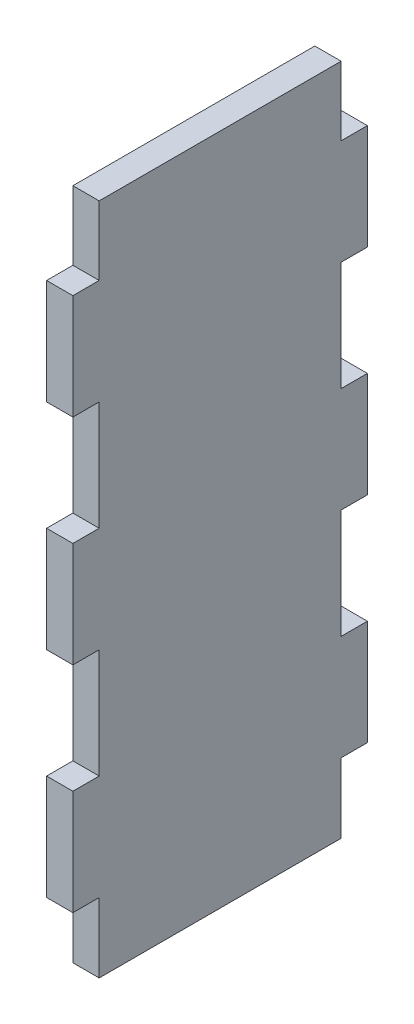
ISO-10303-21;
HEADER;
FILE_DESCRIPTION(('STEP AP214'),'2;1');
FILE_NAME('part.step','',(''),(''),'','','');
FILE_SCHEMA(('AUTOMOTIVE_DESIGN { 1 0 10303 214 1 1 1 1 }'));
ENDSEC;
DATA;
#1=APPLICATION_CONTEXT('core data for automotive mechanical design processes');
#2=APPLICATION_PROTOCOL_DEFINITION('international standard','automotive_design',2000,#1);
#3=PRODUCT_CONTEXT('',#1,'mechanical');
#4=PRODUCT('Part','Part','',(#3));
#5=PRODUCT_RELATED_PRODUCT_CATEGORY('part','',(#4));
#6=PRODUCT_DEFINITION_FORMATION('','',#4);
#7=PRODUCT_DEFINITION_CONTEXT('part definition',#1,'design');
#8=PRODUCT_DEFINITION('design','',#6,#7);
#9=PRODUCT_DEFINITION_SHAPE('','',#8);
#10=(LENGTH_UNIT() NAMED_UNIT(*) SI_UNIT(.MILLI.,.METRE.));
#11=(NAMED_UNIT(*) PLANE_ANGLE_UNIT() SI_UNIT($,.RADIAN.));
#12=(NAMED_UNIT(*) SI_UNIT($,.STERADIAN.) SOLID_ANGLE_UNIT());
#13=UNCERTAINTY_MEASURE_WITH_UNIT(LENGTH_MEASURE(1.E-05),#10,'distance_accuracy_value','');
#14=(GEOMETRIC_REPRESENTATION_CONTEXT(3) GLOBAL_UNCERTAINTY_ASSIGNED_CONTEXT((#13)) GLOBAL_UNIT_ASSIGNED_CONTEXT((#10,
#11,#12)) REPRESENTATION_CONTEXT('',''));
#15=CARTESIAN_POINT('',(0.,0.,0.));
#16=DIRECTION('',(0.,0.,1.));
#17=DIRECTION('',(1.,0.,0.));
#18=AXIS2_PLACEMENT_3D('',#15,#16,#17);
#19=CARTESIAN_POINT('',(3.175,-45.466,17.78));
#20=DIRECTION('',(1.,0.,0.));
#21=DIRECTION('',(0.,0.,-1.));
#22=AXIS2_PLACEMENT_3D('',#19,#20,#21);
#23=PLANE('',#22);
#24=DIRECTION('',(0.,1.,0.));
#25=VECTOR('',#24,1.);
#26=CARTESIAN_POINT('',(3.175,-32.258,14.605));
#27=LINE('',#26,#25);
#28=CARTESIAN_POINT('',(3.175,-40.6736683322111,14.605));
#29=VERTEX_POINT('',#28);
#30=CARTESIAN_POINT('',(3.175,-32.258,14.605));
#31=VERTEX_POINT('',#30);
#32=EDGE_CURVE('E241',#29,#31,#27,.T.);
#33=ORIENTED_EDGE('',*,*,#32,.F.);
#34=DIRECTION('',(0.,0.,1.));
#35=VECTOR('',#34,1.);
#36=CARTESIAN_POINT('',(3.175,-40.6736683322111,-17.78));
#37=LINE('',#36,#35);
#38=CARTESIAN_POINT('',(3.175,-40.6736683322111,-14.605));
#39=VERTEX_POINT('',#38);
#40=EDGE_CURVE('E47',#39,#29,#37,.T.);
#41=ORIENTED_EDGE('',*,*,#40,.F.);
#42=DIRECTION('',(0.,-1.,0.));
#43=VECTOR('',#42,1.);
#44=CARTESIAN_POINT('',(3.175,-32.258,-14.605));
#45=LINE('',#44,#43);
#46=CARTESIAN_POINT('',(3.175,-32.258,-14.605));
#47=VERTEX_POINT('',#46);
#48=EDGE_CURVE('E308',#47,#39,#45,.T.);
#49=ORIENTED_EDGE('',*,*,#48,.F.);
#50=DIRECTION('',(0.,0.,1.));
#51=VECTOR('',#50,1.);
#52=CARTESIAN_POINT('',(3.175,-32.258,-17.78));
#53=LINE('',#52,#51);
#54=CARTESIAN_POINT('',(3.175,-32.258,-17.78));
#55=VERTEX_POINT('',#54);
#56=EDGE_CURVE('E300',#55,#47,#53,.T.);
#57=ORIENTED_EDGE('',*,*,#56,.F.);
#58=DIRECTION('',(0.,1.,0.));
#59=VECTOR('',#58,1.);
#60=CARTESIAN_POINT('',(3.175,45.466,-17.78));
#61=LINE('',#60,#59);
#62=CARTESIAN_POINT('',(3.175,-19.558,-17.78));
#63=VERTEX_POINT('',#62);
#64=EDGE_CURVE('E40',#55,#63,#61,.T.);
#65=ORIENTED_EDGE('',*,*,#64,.T.);
#66=DIRECTION('',(0.,0.,-1.));
#67=VECTOR('',#66,1.);
#68=CARTESIAN_POINT('',(3.175,-19.558,-17.78));
#69=LINE('',#68,#67);
#70=CARTESIAN_POINT('',(3.175,-19.558,-14.605));
#71=VERTEX_POINT('',#70);
#72=EDGE_CURVE('E418',#71,#63,#69,.T.);
#73=ORIENTED_EDGE('',*,*,#72,.F.);
#74=DIRECTION('',(0.,-1.,0.));
#75=VECTOR('',#74,1.);
#76=CARTESIAN_POINT('',(3.175,-6.35,-14.605));
#77=LINE('',#76,#75);
#78=CARTESIAN_POINT('',(3.175,-6.35,-14.605));
#79=VERTEX_POINT('',#78);
#80=EDGE_CURVE('E426',#79,#71,#77,.T.);
#81=ORIENTED_EDGE('',*,*,#80,.F.);
#82=DIRECTION('',(0.,0.,1.));
#83=VECTOR('',#82,1.);
#84=CARTESIAN_POINT('',(3.175,-6.35,-17.78));
#85=LINE('',#84,#83);
#86=CARTESIAN_POINT('',(3.175,-6.35,-17.78));
#87=VERTEX_POINT('',#86);
#88=EDGE_CURVE('E407',#87,#79,#85,.T.);
#89=ORIENTED_EDGE('',*,*,#88,.F.);
#90=CARTESIAN_POINT('',(3.175,6.35,-17.78));
#91=VERTEX_POINT('',#90);
#92=EDGE_CURVE('E343',#87,#91,#61,.T.);
#93=ORIENTED_EDGE('',*,*,#92,.T.);
#94=DIRECTION('',(0.,0.,-1.));
#95=VECTOR('',#94,1.);
#96=CARTESIAN_POINT('',(3.175,6.35,-17.78));
#97=LINE('',#96,#95);
#98=CARTESIAN_POINT('',(3.175,6.35,-14.605));
#99=VERTEX_POINT('',#98);
#100=EDGE_CURVE('E394',#99,#91,#97,.T.);
#101=ORIENTED_EDGE('',*,*,#100,.F.);
#102=DIRECTION('',(0.,-1.,0.));
#103=VECTOR('',#102,1.);
#104=CARTESIAN_POINT('',(3.175,19.558,-14.605));
#105=LINE('',#104,#103);
#106=CARTESIAN_POINT('',(3.175,19.558,-14.605));
#107=VERTEX_POINT('',#106);
#108=EDGE_CURVE('E402',#107,#99,#105,.T.);
#109=ORIENTED_EDGE('',*,*,#108,.F.);
#110=DIRECTION('',(0.,0.,1.));
#111=VECTOR('',#110,1.);
#112=CARTESIAN_POINT('',(3.175,19.558,-17.78));
#113=LINE('',#112,#111);
#114=CARTESIAN_POINT('',(3.175,19.558,-17.78));
#115=VERTEX_POINT('',#114);
#116=EDGE_CURVE('E390',#115,#107,#113,.T.);
#117=ORIENTED_EDGE('',*,*,#116,.F.);
#118=CARTESIAN_POINT('',(3.175,32.258,-17.78));
#119=VERTEX_POINT('',#118);
#120=EDGE_CURVE('E338',#115,#119,#61,.T.);
#121=ORIENTED_EDGE('',*,*,#120,.T.);
#122=DIRECTION('',(0.,0.,-1.));
#123=VECTOR('',#122,1.);
#124=CARTESIAN_POINT('',(3.175,32.258,-17.78));
#125=LINE('',#124,#123);
#126=CARTESIAN_POINT('',(3.175,32.258,-14.605));
#127=VERTEX_POINT('',#126);
#128=EDGE_CURVE('E382',#127,#119,#125,.T.);
#129=ORIENTED_EDGE('',*,*,#128,.F.);
#130=DIRECTION('',(0.,-1.,0.));
#131=VECTOR('',#130,1.);
#132=CARTESIAN_POINT('',(3.175,45.466,-14.605));
#133=LINE('',#132,#131);
#134=CARTESIAN_POINT('',(3.175,40.5809527450316,-14.605));
#135=VERTEX_POINT('',#134);
#136=EDGE_CURVE('E386',#135,#127,#133,.T.);
#137=ORIENTED_EDGE('',*,*,#136,.F.);
#138=DIRECTION('',(0.,0.,1.));
#139=VECTOR('',#138,1.);
#140=CARTESIAN_POINT('',(3.175,40.5809527450316,-17.78));
#141=LINE('',#140,#139);
#142=CARTESIAN_POINT('',(3.175,40.5809527450316,14.605));
#143=VERTEX_POINT('',#142);
#144=EDGE_CURVE('E54',#135,#143,#141,.T.);
#145=ORIENTED_EDGE('',*,*,#144,.T.);
#146=DIRECTION('',(0.,1.,0.));
#147=VECTOR('',#146,1.);
#148=CARTESIAN_POINT('',(3.175,45.466,14.605));
#149=LINE('',#148,#147);
#150=CARTESIAN_POINT('',(3.175,32.258,14.605));
#151=VERTEX_POINT('',#150);
#152=EDGE_CURVE('E323',#151,#143,#149,.T.);
#153=ORIENTED_EDGE('',*,*,#152,.F.);
#154=DIRECTION('',(0.,0.,-1.));
#155=VECTOR('',#154,1.);
#156=CARTESIAN_POINT('',(3.175,32.258,17.78));
#157=LINE('',#156,#155);
#158=CARTESIAN_POINT('',(3.175,32.258,17.78));
#159=VERTEX_POINT('',#158);
#160=EDGE_CURVE('E317',#159,#151,#157,.T.);
#161=ORIENTED_EDGE('',*,*,#160,.F.);
#162=DIRECTION('',(0.,-1.,0.));
#163=VECTOR('',#162,1.);
#164=CARTESIAN_POINT('',(3.175,45.466,17.78));
#165=LINE('',#164,#163);
#166=CARTESIAN_POINT('',(3.175,19.558,17.78));
#167=VERTEX_POINT('',#166);
#168=EDGE_CURVE('E335',#159,#167,#165,.T.);
#169=ORIENTED_EDGE('',*,*,#168,.T.);
#170=DIRECTION('',(0.,0.,1.));
#171=VECTOR('',#170,1.);
#172=CARTESIAN_POINT('',(3.175,19.558,17.78));
#173=LINE('',#172,#171);
#174=CARTESIAN_POINT('',(3.175,19.558,14.605));
#175=VERTEX_POINT('',#174);
#176=EDGE_CURVE('E284',#175,#167,#173,.T.);
#177=ORIENTED_EDGE('',*,*,#176,.F.);
#178=DIRECTION('',(0.,1.,0.));
#179=VECTOR('',#178,1.);
#180=CARTESIAN_POINT('',(3.175,19.558,14.605));
#181=LINE('',#180,#179);
#182=CARTESIAN_POINT('',(3.175,6.35,14.605));
#183=VERTEX_POINT('',#182);
#184=EDGE_CURVE('E293',#183,#175,#181,.T.);
#185=ORIENTED_EDGE('',*,*,#184,.F.);
#186=DIRECTION('',(0.,0.,-1.));
#187=VECTOR('',#186,1.);
#188=CARTESIAN_POINT('',(3.175,6.35,17.78));
#189=LINE('',#188,#187);
#190=CARTESIAN_POINT('',(3.175,6.35,17.78));
#191=VERTEX_POINT('',#190);
#192=EDGE_CURVE('E274',#191,#183,#189,.T.);
#193=ORIENTED_EDGE('',*,*,#192,.F.);
#194=CARTESIAN_POINT('',(3.175,-6.35,17.78));
#195=VERTEX_POINT('',#194);
#196=EDGE_CURVE('E339',#191,#195,#165,.T.);
#197=ORIENTED_EDGE('',*,*,#196,.T.);
#198=DIRECTION('',(0.,0.,1.));
#199=VECTOR('',#198,1.);
#200=CARTESIAN_POINT('',(3.175,-6.35,17.78));
#201=LINE('',#200,#199);
#202=CARTESIAN_POINT('',(3.175,-6.35,14.605));
#203=VERTEX_POINT('',#202);
#204=EDGE_CURVE('E258',#203,#195,#201,.T.);
#205=ORIENTED_EDGE('',*,*,#204,.F.);
#206=DIRECTION('',(0.,1.,0.));
#207=VECTOR('',#206,1.);
#208=CARTESIAN_POINT('',(3.175,-6.35,14.605));
#209=LINE('',#208,#207);
#210=CARTESIAN_POINT('',(3.175,-19.558,14.605));
#211=VERTEX_POINT('',#210);
#212=EDGE_CURVE('E267',#211,#203,#209,.T.);
#213=ORIENTED_EDGE('',*,*,#212,.F.);
#214=DIRECTION('',(0.,0.,-1.));
#215=VECTOR('',#214,1.);
#216=CARTESIAN_POINT('',(3.175,-19.558,17.78));
#217=LINE('',#216,#215);
#218=CARTESIAN_POINT('',(3.175,-19.558,17.78));
#219=VERTEX_POINT('',#218);
#220=EDGE_CURVE('E252',#219,#211,#217,.T.);
#221=ORIENTED_EDGE('',*,*,#220,.F.);
#222=CARTESIAN_POINT('',(3.175,-32.258,17.78));
#223=VERTEX_POINT('',#222);
#224=EDGE_CURVE('E340',#219,#223,#165,.T.);
#225=ORIENTED_EDGE('',*,*,#224,.T.);
#226=DIRECTION('',(0.,0.,1.));
#227=VECTOR('',#226,1.);
#228=CARTESIAN_POINT('',(3.175,-32.258,17.78));
#229=LINE('',#228,#227);
#230=EDGE_CURVE('E238',#31,#223,#229,.T.);
#231=ORIENTED_EDGE('',*,*,#230,.F.);
#232=EDGE_LOOP('',(#33,#41,#49,#57,#65,#73,#81,#89,#93,#101,#109,#117,#121,#129,#137,#145,#153,
#161,#169,#177,#185,#193,#197,#205,#213,#221,#225,#231));
#233=FACE_BOUND('',#232,.T.);
#234=ADVANCED_FACE('F32',(#233),#23,.T.);
#235=CARTESIAN_POINT('',(0.,-45.466,17.78));
#236=DIRECTION('',(1.,0.,0.));
#237=DIRECTION('',(0.,0.,-1.));
#238=AXIS2_PLACEMENT_3D('',#235,#236,#237);
#239=PLANE('',#238);
#240=DIRECTION('',(0.,0.,1.));
#241=VECTOR('',#240,1.);
#242=CARTESIAN_POINT('',(0.,-40.6736683322111,-17.78));
#243=LINE('',#242,#241);
#244=CARTESIAN_POINT('',(0.,-40.6736683322111,-14.605));
#245=VERTEX_POINT('',#244);
#246=CARTESIAN_POINT('',(0.,-40.6736683322111,14.605));
#247=VERTEX_POINT('',#246);
#248=EDGE_CURVE('E216',#245,#247,#243,.T.);
#249=ORIENTED_EDGE('',*,*,#248,.T.);
#250=DIRECTION('',(0.,1.,0.));
#251=VECTOR('',#250,1.);
#252=CARTESIAN_POINT('',(0.,-32.258,14.605));
#253=LINE('',#252,#251);
#254=CARTESIAN_POINT('',(0.,-32.258,14.605));
#255=VERTEX_POINT('',#254);
#256=EDGE_CURVE('E226',#247,#255,#253,.T.);
#257=ORIENTED_EDGE('',*,*,#256,.T.);
#258=DIRECTION('',(0.,0.,1.));
#259=VECTOR('',#258,1.);
#260=CARTESIAN_POINT('',(0.,-32.258,17.78));
#261=LINE('',#260,#259);
#262=CARTESIAN_POINT('',(0.,-32.258,17.78));
#263=VERTEX_POINT('',#262);
#264=EDGE_CURVE('E237',#255,#263,#261,.T.);
#265=ORIENTED_EDGE('',*,*,#264,.T.);
#266=DIRECTION('',(0.,-1.,0.));
#267=VECTOR('',#266,1.);
#268=CARTESIAN_POINT('',(0.,45.466,17.78));
#269=LINE('',#268,#267);
#270=CARTESIAN_POINT('',(0.,-19.558,17.78));
#271=VERTEX_POINT('',#270);
#272=EDGE_CURVE('E333',#271,#263,#269,.T.);
#273=ORIENTED_EDGE('',*,*,#272,.F.);
#274=DIRECTION('',(0.,0.,-1.));
#275=VECTOR('',#274,1.);
#276=CARTESIAN_POINT('',(0.,-19.558,17.78));
#277=LINE('',#276,#275);
#278=CARTESIAN_POINT('',(0.,-19.558,14.605));
#279=VERTEX_POINT('',#278);
#280=EDGE_CURVE('E254',#271,#279,#277,.T.);
#281=ORIENTED_EDGE('',*,*,#280,.T.);
#282=DIRECTION('',(0.,1.,0.));
#283=VECTOR('',#282,1.);
#284=CARTESIAN_POINT('',(0.,-6.35,14.605));
#285=LINE('',#284,#283);
#286=CARTESIAN_POINT('',(0.,-6.35,14.605));
#287=VERTEX_POINT('',#286);
#288=EDGE_CURVE('E257',#279,#287,#285,.T.);
#289=ORIENTED_EDGE('',*,*,#288,.T.);
#290=DIRECTION('',(0.,0.,1.));
#291=VECTOR('',#290,1.);
#292=CARTESIAN_POINT('',(0.,-6.35,17.78));
#293=LINE('',#292,#291);
#294=CARTESIAN_POINT('',(0.,-6.35,17.78));
#295=VERTEX_POINT('',#294);
#296=EDGE_CURVE('E261',#287,#295,#293,.T.);
#297=ORIENTED_EDGE('',*,*,#296,.T.);
#298=CARTESIAN_POINT('',(0.,6.35,17.78));
#299=VERTEX_POINT('',#298);
#300=EDGE_CURVE('E347',#299,#295,#269,.T.);
#301=ORIENTED_EDGE('',*,*,#300,.F.);
#302=DIRECTION('',(0.,0.,-1.));
#303=VECTOR('',#302,1.);
#304=CARTESIAN_POINT('',(0.,6.35,17.78));
#305=LINE('',#304,#303);
#306=CARTESIAN_POINT('',(0.,6.35,14.605));
#307=VERTEX_POINT('',#306);
#308=EDGE_CURVE('E280',#299,#307,#305,.T.);
#309=ORIENTED_EDGE('',*,*,#308,.T.);
#310=DIRECTION('',(0.,1.,0.));
#311=VECTOR('',#310,1.);
#312=CARTESIAN_POINT('',(0.,19.558,14.605));
#313=LINE('',#312,#311);
#314=CARTESIAN_POINT('',(0.,19.558,14.605));
#315=VERTEX_POINT('',#314);
#316=EDGE_CURVE('E283',#307,#315,#313,.T.);
#317=ORIENTED_EDGE('',*,*,#316,.T.);
#318=DIRECTION('',(0.,0.,1.));
#319=VECTOR('',#318,1.);
#320=CARTESIAN_POINT('',(0.,19.558,17.78));
#321=LINE('',#320,#319);
#322=CARTESIAN_POINT('',(0.,19.558,17.78));
#323=VERTEX_POINT('',#322);
#324=EDGE_CURVE('E287',#315,#323,#321,.T.);
#325=ORIENTED_EDGE('',*,*,#324,.T.);
#326=CARTESIAN_POINT('',(0.,32.258,17.78));
#327=VERTEX_POINT('',#326);
#328=EDGE_CURVE('E344',#327,#323,#269,.T.);
#329=ORIENTED_EDGE('',*,*,#328,.F.);
#330=DIRECTION('',(0.,0.,-1.));
#331=VECTOR('',#330,1.);
#332=CARTESIAN_POINT('',(0.,32.258,17.78));
#333=LINE('',#332,#331);
#334=CARTESIAN_POINT('',(0.,32.258,14.605));
#335=VERTEX_POINT('',#334);
#336=EDGE_CURVE('E319',#327,#335,#333,.T.);
#337=ORIENTED_EDGE('',*,*,#336,.T.);
#338=DIRECTION('',(0.,1.,0.));
#339=VECTOR('',#338,1.);
#340=CARTESIAN_POINT('',(0.,45.466,14.605));
#341=LINE('',#340,#339);
#342=CARTESIAN_POINT('',(0.,40.5809527450316,14.605));
#343=VERTEX_POINT('',#342);
#344=EDGE_CURVE('E322',#335,#343,#341,.T.);
#345=ORIENTED_EDGE('',*,*,#344,.T.);
#346=DIRECTION('',(0.,0.,1.));
#347=VECTOR('',#346,1.);
#348=CARTESIAN_POINT('',(0.,40.5809527450316,-17.78));
#349=LINE('',#348,#347);
#350=CARTESIAN_POINT('',(0.,40.5809527450316,-14.605));
#351=VERTEX_POINT('',#350);
#352=EDGE_CURVE('E388',#351,#343,#349,.T.);
#353=ORIENTED_EDGE('',*,*,#352,.F.);
#354=DIRECTION('',(0.,-1.,0.));
#355=VECTOR('',#354,1.);
#356=CARTESIAN_POINT('',(0.,45.466,-14.605));
#357=LINE('',#356,#355);
#358=CARTESIAN_POINT('',(0.,32.258,-14.605));
#359=VERTEX_POINT('',#358);
#360=EDGE_CURVE('E375',#351,#359,#357,.T.);
#361=ORIENTED_EDGE('',*,*,#360,.T.);
#362=DIRECTION('',(0.,0.,-1.));
#363=VECTOR('',#362,1.);
#364=CARTESIAN_POINT('',(0.,32.258,-17.78));
#365=LINE('',#364,#363);
#366=CARTESIAN_POINT('',(0.,32.258,-17.78));
#367=VERTEX_POINT('',#366);
#368=EDGE_CURVE('E372',#359,#367,#365,.T.);
#369=ORIENTED_EDGE('',*,*,#368,.T.);
#370=DIRECTION('',(0.,1.,0.));
#371=VECTOR('',#370,1.);
#372=CARTESIAN_POINT('',(0.,45.466,-17.78));
#373=LINE('',#372,#371);
#374=CARTESIAN_POINT('',(0.,19.558,-17.78));
#375=VERTEX_POINT('',#374);
#376=EDGE_CURVE('E346',#375,#367,#373,.T.);
#377=ORIENTED_EDGE('',*,*,#376,.F.);
#378=DIRECTION('',(0.,0.,1.));
#379=VECTOR('',#378,1.);
#380=CARTESIAN_POINT('',(0.,19.558,-17.78));
#381=LINE('',#380,#379);
#382=CARTESIAN_POINT('',(0.,19.558,-14.605));
#383=VERTEX_POINT('',#382);
#384=EDGE_CURVE('E370',#375,#383,#381,.T.);
#385=ORIENTED_EDGE('',*,*,#384,.T.);
#386=DIRECTION('',(0.,-1.,0.));
#387=VECTOR('',#386,1.);
#388=CARTESIAN_POINT('',(0.,19.558,-14.605));
#389=LINE('',#388,#387);
#390=CARTESIAN_POINT('',(0.,6.35,-14.605));
#391=VERTEX_POINT('',#390);
#392=EDGE_CURVE('E393',#383,#391,#389,.T.);
#393=ORIENTED_EDGE('',*,*,#392,.T.);
#394=DIRECTION('',(0.,0.,-1.));
#395=VECTOR('',#394,1.);
#396=CARTESIAN_POINT('',(0.,6.35,-17.78));
#397=LINE('',#396,#395);
#398=CARTESIAN_POINT('',(0.,6.35,-17.78));
#399=VERTEX_POINT('',#398);
#400=EDGE_CURVE('E396',#391,#399,#397,.T.);
#401=ORIENTED_EDGE('',*,*,#400,.T.);
#402=CARTESIAN_POINT('',(0.,-6.35,-17.78));
#403=VERTEX_POINT('',#402);
#404=EDGE_CURVE('E350',#403,#399,#373,.T.);
#405=ORIENTED_EDGE('',*,*,#404,.F.);
#406=DIRECTION('',(0.,0.,1.));
#407=VECTOR('',#406,1.);
#408=CARTESIAN_POINT('',(0.,-6.35,-17.78));
#409=LINE('',#408,#407);
#410=CARTESIAN_POINT('',(0.,-6.35,-14.605));
#411=VERTEX_POINT('',#410);
#412=EDGE_CURVE('E414',#403,#411,#409,.T.);
#413=ORIENTED_EDGE('',*,*,#412,.T.);
#414=DIRECTION('',(0.,-1.,0.));
#415=VECTOR('',#414,1.);
#416=CARTESIAN_POINT('',(0.,-6.35,-14.605));
#417=LINE('',#416,#415);
#418=CARTESIAN_POINT('',(0.,-19.558,-14.605));
#419=VERTEX_POINT('',#418);
#420=EDGE_CURVE('E417',#411,#419,#417,.T.);
#421=ORIENTED_EDGE('',*,*,#420,.T.);
#422=DIRECTION('',(0.,0.,-1.));
#423=VECTOR('',#422,1.);
#424=CARTESIAN_POINT('',(0.,-19.558,-17.78));
#425=LINE('',#424,#423);
#426=CARTESIAN_POINT('',(0.,-19.558,-17.78));
#427=VERTEX_POINT('',#426);
#428=EDGE_CURVE('E421',#419,#427,#425,.T.);
#429=ORIENTED_EDGE('',*,*,#428,.T.);
#430=CARTESIAN_POINT('',(0.,-32.258,-17.78));
#431=VERTEX_POINT('',#430);
#432=EDGE_CURVE('E348',#431,#427,#373,.T.);
#433=ORIENTED_EDGE('',*,*,#432,.F.);
#434=DIRECTION('',(0.,0.,1.));
#435=VECTOR('',#434,1.);
#436=CARTESIAN_POINT('',(0.,-32.258,-17.78));
#437=LINE('',#436,#435);
#438=CARTESIAN_POINT('',(0.,-32.258,-14.605));
#439=VERTEX_POINT('',#438);
#440=EDGE_CURVE('E306',#431,#439,#437,.T.);
#441=ORIENTED_EDGE('',*,*,#440,.T.);
#442=DIRECTION('',(0.,-1.,0.));
#443=VECTOR('',#442,1.);
#444=CARTESIAN_POINT('',(0.,-32.258,-14.605));
#445=LINE('',#444,#443);
#446=EDGE_CURVE('E230',#439,#245,#445,.T.);
#447=ORIENTED_EDGE('',*,*,#446,.T.);
#448=EDGE_LOOP('',(#249,#257,#265,#273,#281,#289,#297,#301,#309,#317,#325,#329,#337,#345,#353,
#361,#369,#377,#385,#393,#401,#405,#413,#421,#429,#433,#441,#447));
#449=FACE_BOUND('',#448,.T.);
#450=ADVANCED_FACE('F224',(#449),#239,.F.);
#451=CARTESIAN_POINT('',(0.,-32.258,-14.605));
#452=DIRECTION('',(0.,0.,1.));
#453=DIRECTION('',(0.,-1.,0.));
#454=AXIS2_PLACEMENT_3D('',#451,#452,#453);
#455=PLANE('',#454);
#456=DIRECTION('',(1.,0.,0.));
#457=VECTOR('',#456,1.);
#458=CARTESIAN_POINT('',(0.,-40.6736683322111,-14.605));
#459=LINE('',#458,#457);
#460=EDGE_CURVE('E231',#245,#39,#459,.T.);
#461=ORIENTED_EDGE('',*,*,#460,.F.);
#462=ORIENTED_EDGE('',*,*,#446,.F.);
#463=DIRECTION('',(1.,0.,0.));
#464=VECTOR('',#463,1.);
#465=CARTESIAN_POINT('',(0.,-32.258,-14.605));
#466=LINE('',#465,#464);
#467=EDGE_CURVE('E310',#439,#47,#466,.T.);
#468=ORIENTED_EDGE('',*,*,#467,.T.);
#469=ORIENTED_EDGE('',*,*,#48,.T.);
#470=EDGE_LOOP('',(#461,#462,#468,#469));
#471=FACE_BOUND('',#470,.T.);
#472=ADVANCED_FACE('F483',(#471),#455,.F.);
#473=CARTESIAN_POINT('',(0.,-32.258,14.605));
#474=DIRECTION('',(0.,0.,-1.));
#475=DIRECTION('',(0.,1.,0.));
#476=AXIS2_PLACEMENT_3D('',#473,#474,#475);
#477=PLANE('',#476);
#478=DIRECTION('',(1.,0.,0.));
#479=VECTOR('',#478,1.);
#480=CARTESIAN_POINT('',(1.58750000000001,-40.6736683322111,14.605));
#481=LINE('',#480,#479);
#482=EDGE_CURVE('E213',#247,#29,#481,.T.);
#483=ORIENTED_EDGE('',*,*,#482,.T.);
#484=ORIENTED_EDGE('',*,*,#32,.T.);
#485=DIRECTION('',(1.,0.,0.));
#486=VECTOR('',#485,1.);
#487=CARTESIAN_POINT('',(0.,-32.258,14.605));
#488=LINE('',#487,#486);
#489=EDGE_CURVE('E236',#255,#31,#488,.T.);
#490=ORIENTED_EDGE('',*,*,#489,.F.);
#491=ORIENTED_EDGE('',*,*,#256,.F.);
#492=EDGE_LOOP('',(#483,#484,#490,#491));
#493=FACE_BOUND('',#492,.T.);
#494=ADVANCED_FACE('F234',(#493),#477,.F.);
#495=CARTESIAN_POINT('',(0.,45.466,14.605));
#496=DIRECTION('',(0.,0.,-1.));
#497=DIRECTION('',(0.,1.,0.));
#498=AXIS2_PLACEMENT_3D('',#495,#496,#497);
#499=PLANE('',#498);
#500=DIRECTION('',(-1.,0.,0.));
#501=VECTOR('',#500,1.);
#502=CARTESIAN_POINT('',(1.58750000000001,40.5809527450316,14.605));
#503=LINE('',#502,#501);
#504=EDGE_CURVE('E552',#143,#343,#503,.T.);
#505=ORIENTED_EDGE('',*,*,#504,.T.);
#506=ORIENTED_EDGE('',*,*,#344,.F.);
#507=DIRECTION('',(1.,0.,0.));
#508=VECTOR('',#507,1.);
#509=CARTESIAN_POINT('',(0.,32.258,14.605));
#510=LINE('',#509,#508);
#511=EDGE_CURVE('E331',#335,#151,#510,.T.);
#512=ORIENTED_EDGE('',*,*,#511,.T.);
#513=ORIENTED_EDGE('',*,*,#152,.T.);
#514=EDGE_LOOP('',(#505,#506,#512,#513));
#515=FACE_BOUND('',#514,.T.);
#516=ADVANCED_FACE('F551',(#515),#499,.F.);
#517=CARTESIAN_POINT('',(0.,45.466,-14.605));
#518=DIRECTION('',(0.,0.,1.));
#519=DIRECTION('',(0.,-1.,0.));
#520=AXIS2_PLACEMENT_3D('',#517,#518,#519);
#521=PLANE('',#520);
#522=DIRECTION('',(-1.,0.,0.));
#523=VECTOR('',#522,1.);
#524=CARTESIAN_POINT('',(0.,40.5809527450316,-14.605));
#525=LINE('',#524,#523);
#526=EDGE_CURVE('E11',#135,#351,#525,.T.);
#527=ORIENTED_EDGE('',*,*,#526,.F.);
#528=ORIENTED_EDGE('',*,*,#136,.T.);
#529=DIRECTION('',(1.,0.,0.));
#530=VECTOR('',#529,1.);
#531=CARTESIAN_POINT('',(0.,32.258,-14.605));
#532=LINE('',#531,#530);
#533=EDGE_CURVE('E379',#359,#127,#532,.T.);
#534=ORIENTED_EDGE('',*,*,#533,.F.);
#535=ORIENTED_EDGE('',*,*,#360,.F.);
#536=EDGE_LOOP('',(#527,#528,#534,#535));
#537=FACE_BOUND('',#536,.T.);
#538=ADVANCED_FACE('F499',(#537),#521,.F.);
#539=CARTESIAN_POINT('',(3.175,45.466,-17.78));
#540=DIRECTION('',(0.,0.,1.));
#541=DIRECTION('',(0.,-1.,0.));
#542=AXIS2_PLACEMENT_3D('',#539,#540,#541);
#543=PLANE('',#542);
#544=ORIENTED_EDGE('',*,*,#376,.T.);
#545=DIRECTION('',(1.,0.,0.));
#546=VECTOR('',#545,1.);
#547=CARTESIAN_POINT('',(0.,32.258,-17.78));
#548=LINE('',#547,#546);
#549=EDGE_CURVE('E364',#367,#119,#548,.T.);
#550=ORIENTED_EDGE('',*,*,#549,.T.);
#551=ORIENTED_EDGE('',*,*,#120,.F.);
#552=DIRECTION('',(1.,0.,0.));
#553=VECTOR('',#552,1.);
#554=CARTESIAN_POINT('',(0.,19.558,-17.78));
#555=LINE('',#554,#553);
#556=EDGE_CURVE('E366',#375,#115,#555,.T.);
#557=ORIENTED_EDGE('',*,*,#556,.F.);
#558=EDGE_LOOP('',(#544,#550,#551,#557));
#559=FACE_BOUND('',#558,.T.);
#560=ADVANCED_FACE('F362',(#559),#543,.F.);
#561=ORIENTED_EDGE('',*,*,#404,.T.);
#562=DIRECTION('',(1.,0.,0.));
#563=VECTOR('',#562,1.);
#564=CARTESIAN_POINT('',(0.,6.35,-17.78));
#565=LINE('',#564,#563);
#566=EDGE_CURVE('E408',#399,#91,#565,.T.);
#567=ORIENTED_EDGE('',*,*,#566,.T.);
#568=ORIENTED_EDGE('',*,*,#92,.F.);
#569=DIRECTION('',(1.,0.,0.));
#570=VECTOR('',#569,1.);
#571=CARTESIAN_POINT('',(0.,-6.35,-17.78));
#572=LINE('',#571,#570);
#573=EDGE_CURVE('E247',#403,#87,#572,.T.);
#574=ORIENTED_EDGE('',*,*,#573,.F.);
#575=EDGE_LOOP('',(#561,#567,#568,#574));
#576=FACE_BOUND('',#575,.T.);
#577=ADVANCED_FACE('F454',(#576),#543,.F.);
#578=CARTESIAN_POINT('',(3.175,45.466,17.78));
#579=DIRECTION('',(0.,0.,-1.));
#580=DIRECTION('',(0.,1.,0.));
#581=AXIS2_PLACEMENT_3D('',#578,#579,#580);
#582=PLANE('',#581);
#583=ORIENTED_EDGE('',*,*,#300,.T.);
#584=DIRECTION('',(1.,0.,0.));
#585=VECTOR('',#584,1.);
#586=CARTESIAN_POINT('',(0.,-6.35,17.78));
#587=LINE('',#586,#585);
#588=EDGE_CURVE('E271',#295,#195,#587,.T.);
#589=ORIENTED_EDGE('',*,*,#588,.T.);
#590=ORIENTED_EDGE('',*,*,#196,.F.);
#591=DIRECTION('',(1.,0.,0.));
#592=VECTOR('',#591,1.);
#593=CARTESIAN_POINT('',(0.,6.35,17.78));
#594=LINE('',#593,#592);
#595=EDGE_CURVE('E290',#299,#191,#594,.T.);
#596=ORIENTED_EDGE('',*,*,#595,.F.);
#597=EDGE_LOOP('',(#583,#589,#590,#596));
#598=FACE_BOUND('',#597,.T.);
#599=ADVANCED_FACE('F497',(#598),#582,.F.);
#600=ORIENTED_EDGE('',*,*,#328,.T.);
#601=DIRECTION('',(1.,0.,0.));
#602=VECTOR('',#601,1.);
#603=CARTESIAN_POINT('',(0.,19.558,17.78));
#604=LINE('',#603,#602);
#605=EDGE_CURVE('E297',#323,#167,#604,.T.);
#606=ORIENTED_EDGE('',*,*,#605,.T.);
#607=ORIENTED_EDGE('',*,*,#168,.F.);
#608=DIRECTION('',(1.,0.,0.));
#609=VECTOR('',#608,1.);
#610=CARTESIAN_POINT('',(0.,32.258,17.78));
#611=LINE('',#610,#609);
#612=EDGE_CURVE('E326',#327,#159,#611,.T.);
#613=ORIENTED_EDGE('',*,*,#612,.F.);
#614=EDGE_LOOP('',(#600,#606,#607,#613));
#615=FACE_BOUND('',#614,.T.);
#616=ADVANCED_FACE('F495',(#615),#582,.F.);
#617=ORIENTED_EDGE('',*,*,#272,.T.);
#618=DIRECTION('',(1.,0.,0.));
#619=VECTOR('',#618,1.);
#620=CARTESIAN_POINT('',(0.,-32.258,17.78));
#621=LINE('',#620,#619);
#622=EDGE_CURVE('E249',#263,#223,#621,.T.);
#623=ORIENTED_EDGE('',*,*,#622,.T.);
#624=ORIENTED_EDGE('',*,*,#224,.F.);
#625=DIRECTION('',(1.,0.,0.));
#626=VECTOR('',#625,1.);
#627=CARTESIAN_POINT('',(0.,-19.558,17.78));
#628=LINE('',#627,#626);
#629=EDGE_CURVE('E264',#271,#219,#628,.T.);
#630=ORIENTED_EDGE('',*,*,#629,.F.);
#631=EDGE_LOOP('',(#617,#623,#624,#630));
#632=FACE_BOUND('',#631,.T.);
#633=ADVANCED_FACE('F34',(#632),#582,.F.);
#634=ORIENTED_EDGE('',*,*,#432,.T.);
#635=DIRECTION('',(1.,0.,0.));
#636=VECTOR('',#635,1.);
#637=CARTESIAN_POINT('',(0.,-19.558,-17.78));
#638=LINE('',#637,#636);
#639=EDGE_CURVE('E431',#427,#63,#638,.T.);
#640=ORIENTED_EDGE('',*,*,#639,.T.);
#641=ORIENTED_EDGE('',*,*,#64,.F.);
#642=DIRECTION('',(1.,0.,0.));
#643=VECTOR('',#642,1.);
#644=CARTESIAN_POINT('',(0.,-32.258,-17.78));
#645=LINE('',#644,#643);
#646=EDGE_CURVE('E315',#431,#55,#645,.T.);
#647=ORIENTED_EDGE('',*,*,#646,.F.);
#648=EDGE_LOOP('',(#634,#640,#641,#647));
#649=FACE_BOUND('',#648,.T.);
#650=ADVANCED_FACE('F450',(#649),#543,.F.);
#651=CARTESIAN_POINT('',(0.,32.258,17.78));
#652=DIRECTION('',(0.,-1.,0.));
#653=DIRECTION('',(0.,0.,-1.));
#654=AXIS2_PLACEMENT_3D('',#651,#652,#653);
#655=PLANE('',#654);
#656=ORIENTED_EDGE('',*,*,#160,.T.);
#657=ORIENTED_EDGE('',*,*,#511,.F.);
#658=ORIENTED_EDGE('',*,*,#336,.F.);
#659=ORIENTED_EDGE('',*,*,#612,.T.);
#660=EDGE_LOOP('',(#656,#657,#658,#659));
#661=FACE_BOUND('',#660,.T.);
#662=ADVANCED_FACE('F486',(#661),#655,.F.);
#663=CARTESIAN_POINT('',(0.,-32.258,-17.78));
#664=DIRECTION('',(0.,1.,0.));
#665=DIRECTION('',(0.,0.,1.));
#666=AXIS2_PLACEMENT_3D('',#663,#664,#665);
#667=PLANE('',#666);
#668=ORIENTED_EDGE('',*,*,#56,.T.);
#669=ORIENTED_EDGE('',*,*,#467,.F.);
#670=ORIENTED_EDGE('',*,*,#440,.F.);
#671=ORIENTED_EDGE('',*,*,#646,.T.);
#672=EDGE_LOOP('',(#668,#669,#670,#671));
#673=FACE_BOUND('',#672,.T.);
#674=ADVANCED_FACE('F493',(#673),#667,.F.);
#675=CARTESIAN_POINT('',(0.,19.558,17.78));
#676=DIRECTION('',(0.,1.,0.));
#677=DIRECTION('',(0.,0.,1.));
#678=AXIS2_PLACEMENT_3D('',#675,#676,#677);
#679=PLANE('',#678);
#680=ORIENTED_EDGE('',*,*,#176,.T.);
#681=ORIENTED_EDGE('',*,*,#605,.F.);
#682=ORIENTED_EDGE('',*,*,#324,.F.);
#683=DIRECTION('',(1.,0.,0.));
#684=VECTOR('',#683,1.);
#685=CARTESIAN_POINT('',(0.,19.558,14.605));
#686=LINE('',#685,#684);
#687=EDGE_CURVE('E301',#315,#175,#686,.T.);
#688=ORIENTED_EDGE('',*,*,#687,.T.);
#689=EDGE_LOOP('',(#680,#681,#682,#688));
#690=FACE_BOUND('',#689,.T.);
#691=ADVANCED_FACE('F543',(#690),#679,.F.);
#692=CARTESIAN_POINT('',(0.,19.558,14.605));
#693=DIRECTION('',(0.,0.,-1.));
#694=DIRECTION('',(0.,1.,0.));
#695=AXIS2_PLACEMENT_3D('',#692,#693,#694);
#696=PLANE('',#695);
#697=ORIENTED_EDGE('',*,*,#184,.T.);
#698=ORIENTED_EDGE('',*,*,#687,.F.);
#699=ORIENTED_EDGE('',*,*,#316,.F.);
#700=DIRECTION('',(1.,0.,0.));
#701=VECTOR('',#700,1.);
#702=CARTESIAN_POINT('',(0.,6.35,14.605));
#703=LINE('',#702,#701);
#704=EDGE_CURVE('E303',#307,#183,#703,.T.);
#705=ORIENTED_EDGE('',*,*,#704,.T.);
#706=EDGE_LOOP('',(#697,#698,#699,#705));
#707=FACE_BOUND('',#706,.T.);
#708=ADVANCED_FACE('F541',(#707),#696,.F.);
#709=CARTESIAN_POINT('',(0.,6.35,17.78));
#710=DIRECTION('',(0.,-1.,0.));
#711=DIRECTION('',(0.,0.,-1.));
#712=AXIS2_PLACEMENT_3D('',#709,#710,#711);
#713=PLANE('',#712);
#714=ORIENTED_EDGE('',*,*,#192,.T.);
#715=ORIENTED_EDGE('',*,*,#704,.F.);
#716=ORIENTED_EDGE('',*,*,#308,.F.);
#717=ORIENTED_EDGE('',*,*,#595,.T.);
#718=EDGE_LOOP('',(#714,#715,#716,#717));
#719=FACE_BOUND('',#718,.T.);
#720=ADVANCED_FACE('F537',(#719),#713,.F.);
#721=CARTESIAN_POINT('',(0.,-6.35,17.78));
#722=DIRECTION('',(0.,1.,0.));
#723=DIRECTION('',(0.,0.,1.));
#724=AXIS2_PLACEMENT_3D('',#721,#722,#723);
#725=PLANE('',#724);
#726=ORIENTED_EDGE('',*,*,#204,.T.);
#727=ORIENTED_EDGE('',*,*,#588,.F.);
#728=ORIENTED_EDGE('',*,*,#296,.F.);
#729=DIRECTION('',(1.,0.,0.));
#730=VECTOR('',#729,1.);
#731=CARTESIAN_POINT('',(0.,-6.35,14.605));
#732=LINE('',#731,#730);
#733=EDGE_CURVE('E275',#287,#203,#732,.T.);
#734=ORIENTED_EDGE('',*,*,#733,.T.);
#735=EDGE_LOOP('',(#726,#727,#728,#734));
#736=FACE_BOUND('',#735,.T.);
#737=ADVANCED_FACE('F531',(#736),#725,.F.);
#738=CARTESIAN_POINT('',(0.,-6.35,14.605));
#739=DIRECTION('',(0.,0.,-1.));
#740=DIRECTION('',(0.,1.,0.));
#741=AXIS2_PLACEMENT_3D('',#738,#739,#740);
#742=PLANE('',#741);
#743=ORIENTED_EDGE('',*,*,#212,.T.);
#744=ORIENTED_EDGE('',*,*,#733,.F.);
#745=ORIENTED_EDGE('',*,*,#288,.F.);
#746=DIRECTION('',(1.,0.,0.));
#747=VECTOR('',#746,1.);
#748=CARTESIAN_POINT('',(0.,-19.558,14.605));
#749=LINE('',#748,#747);
#750=EDGE_CURVE('E277',#279,#211,#749,.T.);
#751=ORIENTED_EDGE('',*,*,#750,.T.);
#752=EDGE_LOOP('',(#743,#744,#745,#751));
#753=FACE_BOUND('',#752,.T.);
#754=ADVANCED_FACE('F528',(#753),#742,.F.);
#755=CARTESIAN_POINT('',(0.,-19.558,17.78));
#756=DIRECTION('',(0.,-1.,0.));
#757=DIRECTION('',(0.,0.,-1.));
#758=AXIS2_PLACEMENT_3D('',#755,#756,#757);
#759=PLANE('',#758);
#760=ORIENTED_EDGE('',*,*,#220,.T.);
#761=ORIENTED_EDGE('',*,*,#750,.F.);
#762=ORIENTED_EDGE('',*,*,#280,.F.);
#763=ORIENTED_EDGE('',*,*,#629,.T.);
#764=EDGE_LOOP('',(#760,#761,#762,#763));
#765=FACE_BOUND('',#764,.T.);
#766=ADVANCED_FACE('F526',(#765),#759,.F.);
#767=CARTESIAN_POINT('',(0.,-32.258,17.78));
#768=DIRECTION('',(0.,1.,0.));
#769=DIRECTION('',(0.,0.,1.));
#770=AXIS2_PLACEMENT_3D('',#767,#768,#769);
#771=PLANE('',#770);
#772=ORIENTED_EDGE('',*,*,#230,.T.);
#773=ORIENTED_EDGE('',*,*,#622,.F.);
#774=ORIENTED_EDGE('',*,*,#264,.F.);
#775=ORIENTED_EDGE('',*,*,#489,.T.);
#776=EDGE_LOOP('',(#772,#773,#774,#775));
#777=FACE_BOUND('',#776,.T.);
#778=ADVANCED_FACE('F519',(#777),#771,.F.);
#779=CARTESIAN_POINT('',(0.,-6.35,-17.78));
#780=DIRECTION('',(0.,1.,0.));
#781=DIRECTION('',(0.,0.,1.));
#782=AXIS2_PLACEMENT_3D('',#779,#780,#781);
#783=PLANE('',#782);
#784=ORIENTED_EDGE('',*,*,#88,.T.);
#785=DIRECTION('',(1.,0.,0.));
#786=VECTOR('',#785,1.);
#787=CARTESIAN_POINT('',(0.,-6.35,-14.605));
#788=LINE('',#787,#786);
#789=EDGE_CURVE('E244',#411,#79,#788,.T.);
#790=ORIENTED_EDGE('',*,*,#789,.F.);
#791=ORIENTED_EDGE('',*,*,#412,.F.);
#792=ORIENTED_EDGE('',*,*,#573,.T.);
#793=EDGE_LOOP('',(#784,#790,#791,#792));
#794=FACE_BOUND('',#793,.T.);
#795=ADVANCED_FACE('F442',(#794),#783,.F.);
#796=CARTESIAN_POINT('',(0.,-19.558,-17.78));
#797=DIRECTION('',(0.,-1.,0.));
#798=DIRECTION('',(0.,0.,-1.));
#799=AXIS2_PLACEMENT_3D('',#796,#797,#798);
#800=PLANE('',#799);
#801=ORIENTED_EDGE('',*,*,#72,.T.);
#802=ORIENTED_EDGE('',*,*,#639,.F.);
#803=ORIENTED_EDGE('',*,*,#428,.F.);
#804=DIRECTION('',(1.,0.,0.));
#805=VECTOR('',#804,1.);
#806=CARTESIAN_POINT('',(0.,-19.558,-14.605));
#807=LINE('',#806,#805);
#808=EDGE_CURVE('E432',#419,#71,#807,.T.);
#809=ORIENTED_EDGE('',*,*,#808,.T.);
#810=EDGE_LOOP('',(#801,#802,#803,#809));
#811=FACE_BOUND('',#810,.T.);
#812=ADVANCED_FACE('F449',(#811),#800,.F.);
#813=CARTESIAN_POINT('',(0.,-6.35,-14.605));
#814=DIRECTION('',(0.,0.,1.));
#815=DIRECTION('',(0.,-1.,0.));
#816=AXIS2_PLACEMENT_3D('',#813,#814,#815);
#817=PLANE('',#816);
#818=ORIENTED_EDGE('',*,*,#80,.T.);
#819=ORIENTED_EDGE('',*,*,#808,.F.);
#820=ORIENTED_EDGE('',*,*,#420,.F.);
#821=ORIENTED_EDGE('',*,*,#789,.T.);
#822=EDGE_LOOP('',(#818,#819,#820,#821));
#823=FACE_BOUND('',#822,.T.);
#824=ADVANCED_FACE('F437',(#823),#817,.F.);
#825=CARTESIAN_POINT('',(0.,19.558,-17.78));
#826=DIRECTION('',(0.,1.,0.));
#827=DIRECTION('',(0.,0.,1.));
#828=AXIS2_PLACEMENT_3D('',#825,#826,#827);
#829=PLANE('',#828);
#830=ORIENTED_EDGE('',*,*,#116,.T.);
#831=DIRECTION('',(1.,0.,0.));
#832=VECTOR('',#831,1.);
#833=CARTESIAN_POINT('',(0.,19.558,-14.605));
#834=LINE('',#833,#832);
#835=EDGE_CURVE('E399',#383,#107,#834,.T.);
#836=ORIENTED_EDGE('',*,*,#835,.F.);
#837=ORIENTED_EDGE('',*,*,#384,.F.);
#838=ORIENTED_EDGE('',*,*,#556,.T.);
#839=EDGE_LOOP('',(#830,#836,#837,#838));
#840=FACE_BOUND('',#839,.T.);
#841=ADVANCED_FACE('F461',(#840),#829,.F.);
#842=CARTESIAN_POINT('',(0.,6.35,-17.78));
#843=DIRECTION('',(0.,-1.,0.));
#844=DIRECTION('',(0.,0.,-1.));
#845=AXIS2_PLACEMENT_3D('',#842,#843,#844);
#846=PLANE('',#845);
#847=ORIENTED_EDGE('',*,*,#100,.T.);
#848=ORIENTED_EDGE('',*,*,#566,.F.);
#849=ORIENTED_EDGE('',*,*,#400,.F.);
#850=DIRECTION('',(1.,0.,0.));
#851=VECTOR('',#850,1.);
#852=CARTESIAN_POINT('',(0.,6.35,-14.605));
#853=LINE('',#852,#851);
#854=EDGE_CURVE('E411',#391,#99,#853,.T.);
#855=ORIENTED_EDGE('',*,*,#854,.T.);
#856=EDGE_LOOP('',(#847,#848,#849,#855));
#857=FACE_BOUND('',#856,.T.);
#858=ADVANCED_FACE('F467',(#857),#846,.F.);
#859=CARTESIAN_POINT('',(0.,19.558,-14.605));
#860=DIRECTION('',(0.,0.,1.));
#861=DIRECTION('',(0.,-1.,0.));
#862=AXIS2_PLACEMENT_3D('',#859,#860,#861);
#863=PLANE('',#862);
#864=ORIENTED_EDGE('',*,*,#108,.T.);
#865=ORIENTED_EDGE('',*,*,#854,.F.);
#866=ORIENTED_EDGE('',*,*,#392,.F.);
#867=ORIENTED_EDGE('',*,*,#835,.T.);
#868=EDGE_LOOP('',(#864,#865,#866,#867));
#869=FACE_BOUND('',#868,.T.);
#870=ADVANCED_FACE('F465',(#869),#863,.F.);
#871=CARTESIAN_POINT('',(0.,32.258,-17.78));
#872=DIRECTION('',(0.,-1.,0.));
#873=DIRECTION('',(0.,0.,-1.));
#874=AXIS2_PLACEMENT_3D('',#871,#872,#873);
#875=PLANE('',#874);
#876=ORIENTED_EDGE('',*,*,#128,.T.);
#877=ORIENTED_EDGE('',*,*,#549,.F.);
#878=ORIENTED_EDGE('',*,*,#368,.F.);
#879=ORIENTED_EDGE('',*,*,#533,.T.);
#880=EDGE_LOOP('',(#876,#877,#878,#879));
#881=FACE_BOUND('',#880,.T.);
#882=ADVANCED_FACE('F474',(#881),#875,.F.);
#883=CARTESIAN_POINT('',(1.58750000000001,40.5809527450316,-17.78));
#884=DIRECTION('',(0.,1.,0.));
#885=DIRECTION('',(0.,0.,1.));
#886=AXIS2_PLACEMENT_3D('',#883,#884,#885);
#887=PLANE('',#886);
#888=ORIENTED_EDGE('',*,*,#526,.T.);
#889=ORIENTED_EDGE('',*,*,#352,.T.);
#890=ORIENTED_EDGE('',*,*,#504,.F.);
#891=ORIENTED_EDGE('',*,*,#144,.F.);
#892=EDGE_LOOP('',(#888,#889,#890,#891));
#893=FACE_BOUND('',#892,.T.);
#894=ADVANCED_FACE('F557',(#893),#887,.T.);
#895=CARTESIAN_POINT('',(1.58750000000001,-40.6736683322111,-17.78));
#896=DIRECTION('',(0.,-1.,0.));
#897=DIRECTION('',(0.,0.,-1.));
#898=AXIS2_PLACEMENT_3D('',#895,#896,#897);
#899=PLANE('',#898);
#900=ORIENTED_EDGE('',*,*,#460,.T.);
#901=ORIENTED_EDGE('',*,*,#40,.T.);
#902=ORIENTED_EDGE('',*,*,#482,.F.);
#903=ORIENTED_EDGE('',*,*,#248,.F.);
#904=EDGE_LOOP('',(#900,#901,#902,#903));
#905=FACE_BOUND('',#904,.T.);
#906=ADVANCED_FACE('F215',(#905),#899,.T.);
#907=CLOSED_SHELL('',(#234,#450,#472,#494,#516,#538,#560,#577,#599,#616,#633,#650,#662,#674,
#691,#708,#720,#737,#754,#766,#778,#795,#812,#824,#841,#858,#870,#882,#894,#906));
#908=MANIFOLD_SOLID_BREP('B2',#907);
#909=ADVANCED_BREP_SHAPE_REPRESENTATION('',(#18,#908),#14);
#910=SHAPE_DEFINITION_REPRESENTATION(#9,#909);
ENDSEC;
END-ISO-10303-21;
